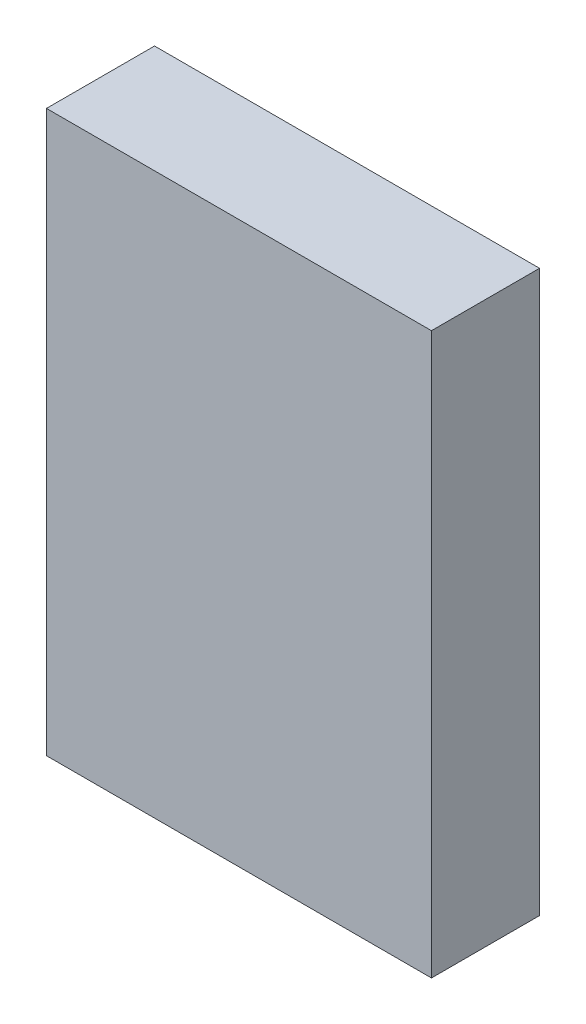
ISO-10303-21;
HEADER;
FILE_DESCRIPTION(('STEP AP214'),'2;1');
FILE_NAME('part.step','',(''),(''),'','','');
FILE_SCHEMA(('AUTOMOTIVE_DESIGN { 1 0 10303 214 1 1 1 1 }'));
ENDSEC;
DATA;
#1=APPLICATION_CONTEXT('core data for automotive mechanical design processes');
#2=APPLICATION_PROTOCOL_DEFINITION('international standard','automotive_design',2000,#1);
#3=PRODUCT_CONTEXT('',#1,'mechanical');
#4=PRODUCT('Part','Part','',(#3));
#5=PRODUCT_RELATED_PRODUCT_CATEGORY('part','',(#4));
#6=PRODUCT_DEFINITION_FORMATION('','',#4);
#7=PRODUCT_DEFINITION_CONTEXT('part definition',#1,'design');
#8=PRODUCT_DEFINITION('design','',#6,#7);
#9=PRODUCT_DEFINITION_SHAPE('','',#8);
#10=(LENGTH_UNIT() NAMED_UNIT(*) SI_UNIT(.MILLI.,.METRE.));
#11=(NAMED_UNIT(*) PLANE_ANGLE_UNIT() SI_UNIT($,.RADIAN.));
#12=(NAMED_UNIT(*) SI_UNIT($,.STERADIAN.) SOLID_ANGLE_UNIT());
#13=UNCERTAINTY_MEASURE_WITH_UNIT(LENGTH_MEASURE(1.E-05),#10,'distance_accuracy_value','');
#14=(GEOMETRIC_REPRESENTATION_CONTEXT(3) GLOBAL_UNCERTAINTY_ASSIGNED_CONTEXT((#13)) GLOBAL_UNIT_ASSIGNED_CONTEXT((#10,
#11,#12)) REPRESENTATION_CONTEXT('',''));
#15=CARTESIAN_POINT('',(0.,0.,0.));
#16=DIRECTION('',(0.,0.,1.));
#17=DIRECTION('',(1.,0.,0.));
#18=AXIS2_PLACEMENT_3D('',#15,#16,#17);
#19=CARTESIAN_POINT('',(0.,0.,16.));
#20=DIRECTION('',(0.,1.,0.));
#21=DIRECTION('',(0.,0.,1.));
#22=AXIS2_PLACEMENT_3D('',#19,#20,#21);
#23=PLANE('',#22);
#24=DIRECTION('',(1.,0.,0.));
#25=VECTOR('',#24,1.);
#26=CARTESIAN_POINT('',(0.,0.,0.));
#27=LINE('',#26,#25);
#28=CARTESIAN_POINT('',(-57.,0.,0.));
#29=VERTEX_POINT('',#28);
#30=CARTESIAN_POINT('',(0.,0.,0.));
#31=VERTEX_POINT('',#30);
#32=EDGE_CURVE('E107',#29,#31,#27,.T.);
#33=ORIENTED_EDGE('',*,*,#32,.T.);
#34=DIRECTION('',(0.,0.,-1.));
#35=VECTOR('',#34,1.);
#36=CARTESIAN_POINT('',(0.,0.,16.));
#37=LINE('',#36,#35);
#38=CARTESIAN_POINT('',(0.,0.,16.));
#39=VERTEX_POINT('',#38);
#40=EDGE_CURVE('E11',#39,#31,#37,.T.);
#41=ORIENTED_EDGE('',*,*,#40,.F.);
#42=DIRECTION('',(1.,0.,0.));
#43=VECTOR('',#42,1.);
#44=CARTESIAN_POINT('',(0.,0.,16.));
#45=LINE('',#44,#43);
#46=CARTESIAN_POINT('',(-57.,0.,16.));
#47=VERTEX_POINT('',#46);
#48=EDGE_CURVE('E95',#47,#39,#45,.T.);
#49=ORIENTED_EDGE('',*,*,#48,.F.);
#50=DIRECTION('',(0.,0.,-1.));
#51=VECTOR('',#50,1.);
#52=CARTESIAN_POINT('',(-57.,0.,16.));
#53=LINE('',#52,#51);
#54=EDGE_CURVE('E103',#47,#29,#53,.T.);
#55=ORIENTED_EDGE('',*,*,#54,.T.);
#56=EDGE_LOOP('',(#33,#41,#49,#55));
#57=FACE_BOUND('',#56,.T.);
#58=ADVANCED_FACE('F44',(#57),#23,.F.);
#59=CARTESIAN_POINT('',(0.,0.,16.));
#60=DIRECTION('',(-1.,0.,0.));
#61=DIRECTION('',(0.,0.,1.));
#62=AXIS2_PLACEMENT_3D('',#59,#60,#61);
#63=PLANE('',#62);
#64=DIRECTION('',(0.,1.,0.));
#65=VECTOR('',#64,1.);
#66=CARTESIAN_POINT('',(0.,0.,0.));
#67=LINE('',#66,#65);
#68=CARTESIAN_POINT('',(0.,83.,0.));
#69=VERTEX_POINT('',#68);
#70=EDGE_CURVE('E99',#31,#69,#67,.T.);
#71=ORIENTED_EDGE('',*,*,#70,.T.);
#72=DIRECTION('',(0.,0.,-1.));
#73=VECTOR('',#72,1.);
#74=CARTESIAN_POINT('',(0.,83.,16.));
#75=LINE('',#74,#73);
#76=CARTESIAN_POINT('',(0.,83.,16.));
#77=VERTEX_POINT('',#76);
#78=EDGE_CURVE('E52',#77,#69,#75,.T.);
#79=ORIENTED_EDGE('',*,*,#78,.F.);
#80=DIRECTION('',(0.,1.,0.));
#81=VECTOR('',#80,1.);
#82=CARTESIAN_POINT('',(0.,0.,16.));
#83=LINE('',#82,#81);
#84=EDGE_CURVE('E90',#39,#77,#83,.T.);
#85=ORIENTED_EDGE('',*,*,#84,.F.);
#86=ORIENTED_EDGE('',*,*,#40,.T.);
#87=EDGE_LOOP('',(#71,#79,#85,#86));
#88=FACE_BOUND('',#87,.T.);
#89=ADVANCED_FACE('F98',(#88),#63,.F.);
#90=CARTESIAN_POINT('',(0.,83.,16.));
#91=DIRECTION('',(0.,-1.,0.));
#92=DIRECTION('',(0.,0.,-1.));
#93=AXIS2_PLACEMENT_3D('',#90,#91,#92);
#94=PLANE('',#93);
#95=DIRECTION('',(-1.,0.,0.));
#96=VECTOR('',#95,1.);
#97=CARTESIAN_POINT('',(0.,83.,0.));
#98=LINE('',#97,#96);
#99=CARTESIAN_POINT('',(-57.,83.,0.));
#100=VERTEX_POINT('',#99);
#101=EDGE_CURVE('E77',#69,#100,#98,.T.);
#102=ORIENTED_EDGE('',*,*,#101,.T.);
#103=DIRECTION('',(0.,0.,-1.));
#104=VECTOR('',#103,1.);
#105=CARTESIAN_POINT('',(-57.,83.,16.));
#106=LINE('',#105,#104);
#107=CARTESIAN_POINT('',(-57.,83.,16.));
#108=VERTEX_POINT('',#107);
#109=EDGE_CURVE('E100',#108,#100,#106,.T.);
#110=ORIENTED_EDGE('',*,*,#109,.F.);
#111=DIRECTION('',(-1.,0.,0.));
#112=VECTOR('',#111,1.);
#113=CARTESIAN_POINT('',(0.,83.,16.));
#114=LINE('',#113,#112);
#115=EDGE_CURVE('E93',#77,#108,#114,.T.);
#116=ORIENTED_EDGE('',*,*,#115,.F.);
#117=ORIENTED_EDGE('',*,*,#78,.T.);
#118=EDGE_LOOP('',(#102,#110,#116,#117));
#119=FACE_BOUND('',#118,.T.);
#120=ADVANCED_FACE('F101',(#119),#94,.F.);
#121=CARTESIAN_POINT('',(-57.,0.,16.));
#122=DIRECTION('',(1.,0.,0.));
#123=DIRECTION('',(0.,0.,-1.));
#124=AXIS2_PLACEMENT_3D('',#121,#122,#123);
#125=PLANE('',#124);
#126=DIRECTION('',(0.,-1.,0.));
#127=VECTOR('',#126,1.);
#128=CARTESIAN_POINT('',(-57.,0.,0.));
#129=LINE('',#128,#127);
#130=EDGE_CURVE('E83',#100,#29,#129,.T.);
#131=ORIENTED_EDGE('',*,*,#130,.T.);
#132=ORIENTED_EDGE('',*,*,#54,.F.);
#133=DIRECTION('',(0.,-1.,0.));
#134=VECTOR('',#133,1.);
#135=CARTESIAN_POINT('',(-57.,0.,16.));
#136=LINE('',#135,#134);
#137=EDGE_CURVE('E60',#108,#47,#136,.T.);
#138=ORIENTED_EDGE('',*,*,#137,.F.);
#139=ORIENTED_EDGE('',*,*,#109,.T.);
#140=EDGE_LOOP('',(#131,#132,#138,#139));
#141=FACE_BOUND('',#140,.T.);
#142=ADVANCED_FACE('F114',(#141),#125,.F.);
#143=CARTESIAN_POINT('',(0.,0.,16.));
#144=DIRECTION('',(0.,0.,-1.));
#145=DIRECTION('',(-1.,0.,0.));
#146=AXIS2_PLACEMENT_3D('',#143,#144,#145);
#147=PLANE('',#146);
#148=ORIENTED_EDGE('',*,*,#48,.T.);
#149=ORIENTED_EDGE('',*,*,#84,.T.);
#150=ORIENTED_EDGE('',*,*,#115,.T.);
#151=ORIENTED_EDGE('',*,*,#137,.T.);
#152=EDGE_LOOP('',(#148,#149,#150,#151));
#153=FACE_BOUND('',#152,.T.);
#154=ADVANCED_FACE('F91',(#153),#147,.F.);
#155=CARTESIAN_POINT('',(0.,0.,0.));
#156=DIRECTION('',(0.,0.,-1.));
#157=DIRECTION('',(-1.,0.,0.));
#158=AXIS2_PLACEMENT_3D('',#155,#156,#157);
#159=PLANE('',#158);
#160=ORIENTED_EDGE('',*,*,#32,.F.);
#161=ORIENTED_EDGE('',*,*,#130,.F.);
#162=ORIENTED_EDGE('',*,*,#101,.F.);
#163=ORIENTED_EDGE('',*,*,#70,.F.);
#164=EDGE_LOOP('',(#160,#161,#162,#163));
#165=FACE_BOUND('',#164,.T.);
#166=ADVANCED_FACE('F117',(#165),#159,.T.);
#167=CLOSED_SHELL('',(#58,#89,#120,#142,#154,#166));
#168=MANIFOLD_SOLID_BREP('B2',#167);
#169=ADVANCED_BREP_SHAPE_REPRESENTATION('',(#18,#168),#14);
#170=SHAPE_DEFINITION_REPRESENTATION(#9,#169);
ENDSEC;
END-ISO-10303-21;
